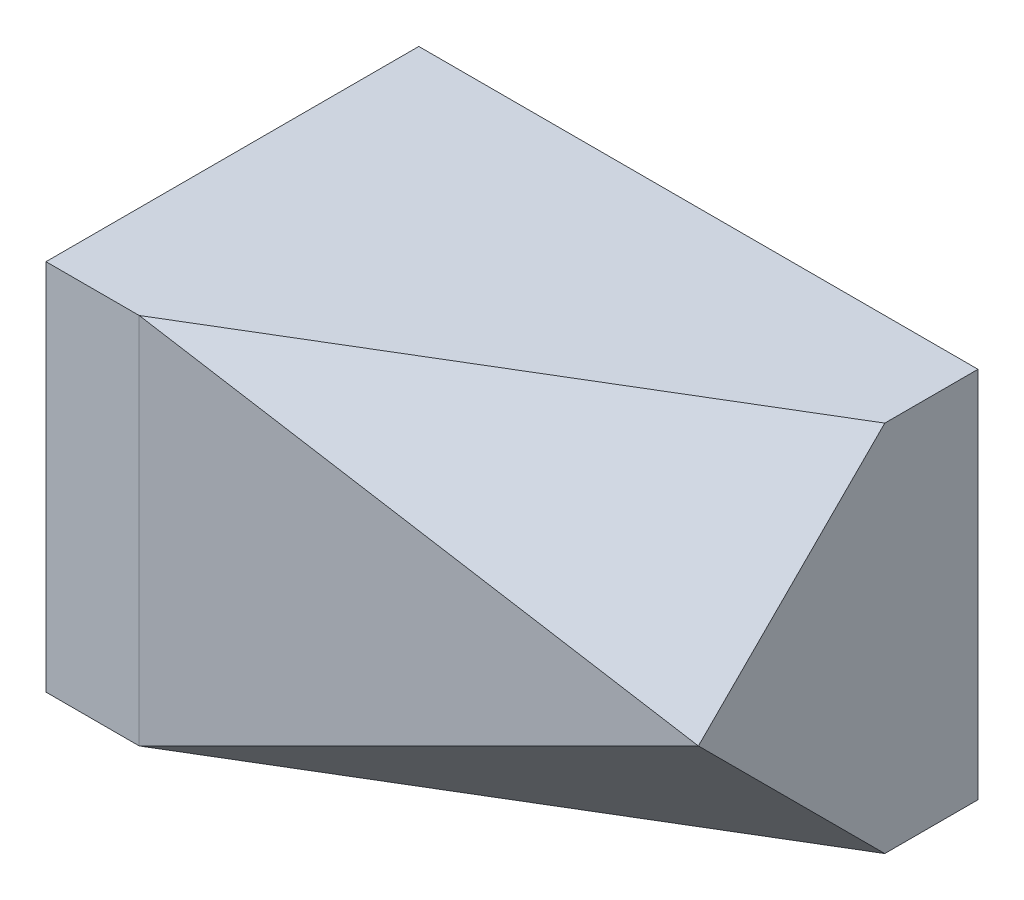
ISO-10303-21;
HEADER;
FILE_DESCRIPTION(('STEP AP214'),'2;1');
FILE_NAME('part.step','',(''),(''),'','','');
FILE_SCHEMA(('AUTOMOTIVE_DESIGN { 1 0 10303 214 1 1 1 1 }'));
ENDSEC;
DATA;
#1=APPLICATION_CONTEXT('core data for automotive mechanical design processes');
#2=APPLICATION_PROTOCOL_DEFINITION('international standard','automotive_design',2000,#1);
#3=PRODUCT_CONTEXT('',#1,'mechanical');
#4=PRODUCT('Part','Part','',(#3));
#5=PRODUCT_RELATED_PRODUCT_CATEGORY('part','',(#4));
#6=PRODUCT_DEFINITION_FORMATION('','',#4);
#7=PRODUCT_DEFINITION_CONTEXT('part definition',#1,'design');
#8=PRODUCT_DEFINITION('design','',#6,#7);
#9=PRODUCT_DEFINITION_SHAPE('','',#8);
#10=(LENGTH_UNIT() NAMED_UNIT(*) SI_UNIT(.MILLI.,.METRE.));
#11=(NAMED_UNIT(*) PLANE_ANGLE_UNIT() SI_UNIT($,.RADIAN.));
#12=(NAMED_UNIT(*) SI_UNIT($,.STERADIAN.) SOLID_ANGLE_UNIT());
#13=UNCERTAINTY_MEASURE_WITH_UNIT(LENGTH_MEASURE(1.E-05),#10,'distance_accuracy_value','');
#14=(GEOMETRIC_REPRESENTATION_CONTEXT(3) GLOBAL_UNCERTAINTY_ASSIGNED_CONTEXT((#13)) GLOBAL_UNIT_ASSIGNED_CONTEXT((#10,
#11,#12)) REPRESENTATION_CONTEXT('',''));
#15=CARTESIAN_POINT('',(0.,0.,0.));
#16=DIRECTION('',(0.,0.,1.));
#17=DIRECTION('',(1.,0.,0.));
#18=AXIS2_PLACEMENT_3D('',#15,#16,#17);
#19=CARTESIAN_POINT('',(15.,20.,5.));
#20=DIRECTION('',(-0.196116135138184,0.,-0.98058067569092));
#21=DIRECTION('',(-0.98058067569092,0.,0.196116135138184));
#22=AXIS2_PLACEMENT_3D('',#19,#20,#21);
#23=PLANE('',#22);
#24=DIRECTION('',(-0.912870929175277,-0.365148371670111,0.182574185835056));
#25=VECTOR('',#24,1.);
#26=CARTESIAN_POINT('',(18.3333333333333,11.3333333333333,4.33333333333333));
#27=LINE('',#26,#25);
#28=CARTESIAN_POINT('',(15.,10.,5.));
#29=VERTEX_POINT('',#28);
#30=CARTESIAN_POINT('',(-10.,0.,10.));
#31=VERTEX_POINT('',#30);
#32=EDGE_CURVE('E96',#29,#31,#27,.T.);
#33=ORIENTED_EDGE('',*,*,#32,.F.);
#34=DIRECTION('',(-0.912870929175277,0.365148371670111,0.182574185835055));
#35=VECTOR('',#34,1.);
#36=CARTESIAN_POINT('',(11.6666666666667,11.3333333333333,5.66666666666666));
#37=LINE('',#36,#35);
#38=CARTESIAN_POINT('',(-9.99999999999998,20.,10.));
#39=VERTEX_POINT('',#38);
#40=EDGE_CURVE('E105',#29,#39,#37,.T.);
#41=ORIENTED_EDGE('',*,*,#40,.T.);
#42=DIRECTION('',(0.,-1.,0.));
#43=VECTOR('',#42,1.);
#44=CARTESIAN_POINT('',(-10.,20.,10.));
#45=LINE('',#44,#43);
#46=EDGE_CURVE('E106',#39,#31,#45,.T.);
#47=ORIENTED_EDGE('',*,*,#46,.T.);
#48=EDGE_LOOP('',(#33,#41,#47));
#49=FACE_BOUND('',#48,.T.);
#50=ADVANCED_FACE('F33',(#49),#23,.F.);
#51=CARTESIAN_POINT('',(15.,20.,-10.));
#52=DIRECTION('',(-1.,0.,0.));
#53=DIRECTION('',(0.,0.,1.));
#54=AXIS2_PLACEMENT_3D('',#51,#52,#53);
#55=PLANE('',#54);
#56=DIRECTION('',(0.,0.707106781186548,0.707106781186548));
#57=VECTOR('',#56,1.);
#58=CARTESIAN_POINT('',(15.,7.5,2.5));
#59=LINE('',#58,#57);
#60=CARTESIAN_POINT('',(15.,0.,-5.));
#61=VERTEX_POINT('',#60);
#62=EDGE_CURVE('E93',#61,#29,#59,.T.);
#63=ORIENTED_EDGE('',*,*,#62,.F.);
#64=DIRECTION('',(0.,0.,-1.));
#65=VECTOR('',#64,1.);
#66=CARTESIAN_POINT('',(15.,0.,-10.));
#67=LINE('',#66,#65);
#68=CARTESIAN_POINT('',(15.,0.,-10.));
#69=VERTEX_POINT('',#68);
#70=EDGE_CURVE('E128',#61,#69,#67,.T.);
#71=ORIENTED_EDGE('',*,*,#70,.T.);
#72=DIRECTION('',(0.,-1.,0.));
#73=VECTOR('',#72,1.);
#74=CARTESIAN_POINT('',(15.,20.,-10.));
#75=LINE('',#74,#73);
#76=CARTESIAN_POINT('',(15.,20.,-10.));
#77=VERTEX_POINT('',#76);
#78=EDGE_CURVE('E132',#77,#69,#75,.T.);
#79=ORIENTED_EDGE('',*,*,#78,.F.);
#80=DIRECTION('',(0.,0.,-1.));
#81=VECTOR('',#80,1.);
#82=CARTESIAN_POINT('',(15.,20.,-10.));
#83=LINE('',#82,#81);
#84=CARTESIAN_POINT('',(15.,20.,-4.99999999999999));
#85=VERTEX_POINT('',#84);
#86=EDGE_CURVE('E114',#85,#77,#83,.T.);
#87=ORIENTED_EDGE('',*,*,#86,.F.);
#88=DIRECTION('',(0.,-0.707106781186548,0.707106781186547));
#89=VECTOR('',#88,1.);
#90=CARTESIAN_POINT('',(15.,22.5,-7.49999999999999));
#91=LINE('',#90,#89);
#92=EDGE_CURVE('E48',#85,#29,#91,.T.);
#93=ORIENTED_EDGE('',*,*,#92,.T.);
#94=EDGE_LOOP('',(#63,#71,#79,#87,#93));
#95=FACE_BOUND('',#94,.T.);
#96=ADVANCED_FACE('F112',(#95),#55,.F.);
#97=CARTESIAN_POINT('',(0.,0.,0.));
#98=DIRECTION('',(0.,-1.,0.));
#99=DIRECTION('',(0.,0.,-1.));
#100=AXIS2_PLACEMENT_3D('',#97,#98,#99);
#101=PLANE('',#100);
#102=ORIENTED_EDGE('',*,*,#70,.F.);
#103=DIRECTION('',(-0.857492925712544,0.,0.514495755427527));
#104=VECTOR('',#103,1.);
#105=CARTESIAN_POINT('',(1.76470588235294,0.,2.94117647058824));
#106=LINE('',#105,#104);
#107=EDGE_CURVE('E98',#61,#31,#106,.T.);
#108=ORIENTED_EDGE('',*,*,#107,.T.);
#109=DIRECTION('',(1.,0.,0.));
#110=VECTOR('',#109,1.);
#111=CARTESIAN_POINT('',(-10.,0.,10.));
#112=LINE('',#111,#110);
#113=CARTESIAN_POINT('',(-15.,0.,10.));
#114=VERTEX_POINT('',#113);
#115=EDGE_CURVE('E125',#114,#31,#112,.T.);
#116=ORIENTED_EDGE('',*,*,#115,.F.);
#117=DIRECTION('',(0.,0.,1.));
#118=VECTOR('',#117,1.);
#119=CARTESIAN_POINT('',(-15.,0.,-10.));
#120=LINE('',#119,#118);
#121=CARTESIAN_POINT('',(-15.,0.,-10.));
#122=VERTEX_POINT('',#121);
#123=EDGE_CURVE('E109',#122,#114,#120,.T.);
#124=ORIENTED_EDGE('',*,*,#123,.F.);
#125=DIRECTION('',(-1.,0.,0.));
#126=VECTOR('',#125,1.);
#127=CARTESIAN_POINT('',(15.,0.,-10.));
#128=LINE('',#127,#126);
#129=EDGE_CURVE('E76',#69,#122,#128,.T.);
#130=ORIENTED_EDGE('',*,*,#129,.F.);
#131=EDGE_LOOP('',(#102,#108,#116,#124,#130));
#132=FACE_BOUND('',#131,.T.);
#133=ADVANCED_FACE('F140',(#132),#101,.T.);
#134=CARTESIAN_POINT('',(-15.,20.,-10.));
#135=DIRECTION('',(1.,0.,0.));
#136=DIRECTION('',(0.,0.,-1.));
#137=AXIS2_PLACEMENT_3D('',#134,#135,#136);
#138=PLANE('',#137);
#139=ORIENTED_EDGE('',*,*,#123,.T.);
#140=DIRECTION('',(0.,-1.,0.));
#141=VECTOR('',#140,1.);
#142=CARTESIAN_POINT('',(-15.,20.,10.));
#143=LINE('',#142,#141);
#144=CARTESIAN_POINT('',(-15.,20.,10.));
#145=VERTEX_POINT('',#144);
#146=EDGE_CURVE('E41',#145,#114,#143,.T.);
#147=ORIENTED_EDGE('',*,*,#146,.F.);
#148=DIRECTION('',(0.,0.,1.));
#149=VECTOR('',#148,1.);
#150=CARTESIAN_POINT('',(-15.,20.,-10.));
#151=LINE('',#150,#149);
#152=CARTESIAN_POINT('',(-15.,20.,-10.));
#153=VERTEX_POINT('',#152);
#154=EDGE_CURVE('E117',#153,#145,#151,.T.);
#155=ORIENTED_EDGE('',*,*,#154,.F.);
#156=DIRECTION('',(0.,-1.,0.));
#157=VECTOR('',#156,1.);
#158=CARTESIAN_POINT('',(-15.,20.,-10.));
#159=LINE('',#158,#157);
#160=EDGE_CURVE('E122',#153,#122,#159,.T.);
#161=ORIENTED_EDGE('',*,*,#160,.T.);
#162=EDGE_LOOP('',(#139,#147,#155,#161));
#163=FACE_BOUND('',#162,.T.);
#164=ADVANCED_FACE('F35',(#163),#138,.F.);
#165=CARTESIAN_POINT('',(-10.,20.,10.));
#166=DIRECTION('',(0.,0.,-1.));
#167=DIRECTION('',(-1.,0.,0.));
#168=AXIS2_PLACEMENT_3D('',#165,#166,#167);
#169=PLANE('',#168);
#170=ORIENTED_EDGE('',*,*,#115,.T.);
#171=ORIENTED_EDGE('',*,*,#46,.F.);
#172=DIRECTION('',(1.,0.,0.));
#173=VECTOR('',#172,1.);
#174=CARTESIAN_POINT('',(-10.,20.,10.));
#175=LINE('',#174,#173);
#176=EDGE_CURVE('E83',#145,#39,#175,.T.);
#177=ORIENTED_EDGE('',*,*,#176,.F.);
#178=ORIENTED_EDGE('',*,*,#146,.T.);
#179=EDGE_LOOP('',(#170,#171,#177,#178));
#180=FACE_BOUND('',#179,.T.);
#181=ADVANCED_FACE('F135',(#180),#169,.F.);
#182=CARTESIAN_POINT('',(15.,20.,-10.));
#183=DIRECTION('',(0.,0.,1.));
#184=DIRECTION('',(1.,0.,0.));
#185=AXIS2_PLACEMENT_3D('',#182,#183,#184);
#186=PLANE('',#185);
#187=ORIENTED_EDGE('',*,*,#129,.T.);
#188=ORIENTED_EDGE('',*,*,#160,.F.);
#189=DIRECTION('',(-1.,0.,0.));
#190=VECTOR('',#189,1.);
#191=CARTESIAN_POINT('',(15.,20.,-10.));
#192=LINE('',#191,#190);
#193=EDGE_CURVE('E56',#77,#153,#192,.T.);
#194=ORIENTED_EDGE('',*,*,#193,.F.);
#195=ORIENTED_EDGE('',*,*,#78,.T.);
#196=EDGE_LOOP('',(#187,#188,#194,#195));
#197=FACE_BOUND('',#196,.T.);
#198=ADVANCED_FACE('F142',(#197),#186,.F.);
#199=CARTESIAN_POINT('',(0.,20.,0.));
#200=DIRECTION('',(0.,-1.,0.));
#201=DIRECTION('',(0.,0.,-1.));
#202=AXIS2_PLACEMENT_3D('',#199,#200,#201);
#203=PLANE('',#202);
#204=ORIENTED_EDGE('',*,*,#176,.T.);
#205=DIRECTION('',(0.857492925712544,0.,-0.514495755427526));
#206=VECTOR('',#205,1.);
#207=CARTESIAN_POINT('',(1.76470588235295,20.,2.94117647058825));
#208=LINE('',#207,#206);
#209=EDGE_CURVE('E11',#39,#85,#208,.T.);
#210=ORIENTED_EDGE('',*,*,#209,.T.);
#211=ORIENTED_EDGE('',*,*,#86,.T.);
#212=ORIENTED_EDGE('',*,*,#193,.T.);
#213=ORIENTED_EDGE('',*,*,#154,.T.);
#214=EDGE_LOOP('',(#204,#210,#211,#212,#213));
#215=FACE_BOUND('',#214,.T.);
#216=ADVANCED_FACE('F143',(#215),#203,.F.);
#217=CARTESIAN_POINT('',(6.10169491525424,10.1694915254237,10.1694915254237));
#218=DIRECTION('',(-0.390566732942472,-0.650944554904119,-0.65094455490412));
#219=DIRECTION('',(0.,0.707106781186548,-0.707106781186547));
#220=AXIS2_PLACEMENT_3D('',#217,#218,#219);
#221=PLANE('',#220);
#222=ORIENTED_EDGE('',*,*,#92,.F.);
#223=ORIENTED_EDGE('',*,*,#209,.F.);
#224=ORIENTED_EDGE('',*,*,#40,.F.);
#225=EDGE_LOOP('',(#222,#223,#224));
#226=FACE_BOUND('',#225,.T.);
#227=ADVANCED_FACE('F108',(#226),#221,.F.);
#228=CARTESIAN_POINT('',(1.01694915254237,-1.69491525423729,1.69491525423729));
#229=DIRECTION('',(0.390566732942472,-0.650944554904119,0.650944554904119));
#230=DIRECTION('',(0.,-0.707106781186548,-0.707106781186548));
#231=AXIS2_PLACEMENT_3D('',#228,#229,#230);
#232=PLANE('',#231);
#233=ORIENTED_EDGE('',*,*,#32,.T.);
#234=ORIENTED_EDGE('',*,*,#107,.F.);
#235=ORIENTED_EDGE('',*,*,#62,.T.);
#236=EDGE_LOOP('',(#233,#234,#235));
#237=FACE_BOUND('',#236,.T.);
#238=ADVANCED_FACE('F95',(#237),#232,.T.);
#239=CLOSED_SHELL('',(#50,#96,#133,#164,#181,#198,#216,#227,#238));
#240=MANIFOLD_SOLID_BREP('B2',#239);
#241=ADVANCED_BREP_SHAPE_REPRESENTATION('',(#18,#240),#14);
#242=SHAPE_DEFINITION_REPRESENTATION(#9,#241);
ENDSEC;
END-ISO-10303-21;
